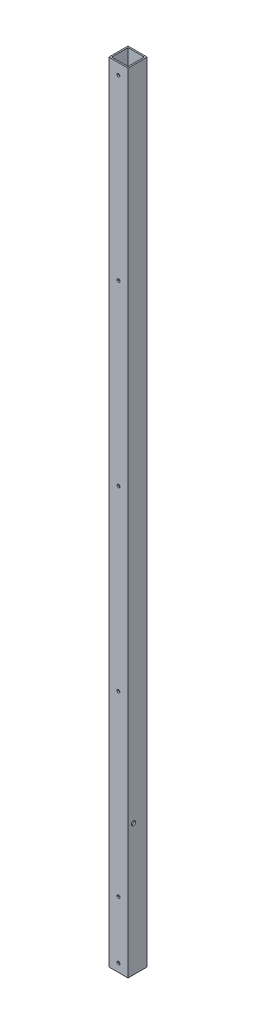
ISO-10303-21;
HEADER;
FILE_DESCRIPTION(('STEP AP214'),'2;1');
FILE_NAME('part.step','',(''),(''),'','','');
FILE_SCHEMA(('AUTOMOTIVE_DESIGN { 1 0 10303 214 1 1 1 1 }'));
ENDSEC;
DATA;
#1=APPLICATION_CONTEXT('core data for automotive mechanical design processes');
#2=APPLICATION_PROTOCOL_DEFINITION('international standard','automotive_design',2000,#1);
#3=PRODUCT_CONTEXT('',#1,'mechanical');
#4=PRODUCT('Part','Part','',(#3));
#5=PRODUCT_RELATED_PRODUCT_CATEGORY('part','',(#4));
#6=PRODUCT_DEFINITION_FORMATION('','',#4);
#7=PRODUCT_DEFINITION_CONTEXT('part definition',#1,'design');
#8=PRODUCT_DEFINITION('design','',#6,#7);
#9=PRODUCT_DEFINITION_SHAPE('','',#8);
#10=(LENGTH_UNIT() NAMED_UNIT(*) SI_UNIT(.MILLI.,.METRE.));
#11=(NAMED_UNIT(*) PLANE_ANGLE_UNIT() SI_UNIT($,.RADIAN.));
#12=(NAMED_UNIT(*) SI_UNIT($,.STERADIAN.) SOLID_ANGLE_UNIT());
#13=UNCERTAINTY_MEASURE_WITH_UNIT(LENGTH_MEASURE(1.E-05),#10,'distance_accuracy_value','');
#14=(GEOMETRIC_REPRESENTATION_CONTEXT(3) GLOBAL_UNCERTAINTY_ASSIGNED_CONTEXT((#13)) GLOBAL_UNIT_ASSIGNED_CONTEXT((#10,
#11,#12)) REPRESENTATION_CONTEXT('',''));
#15=CARTESIAN_POINT('',(0.,0.,0.));
#16=DIRECTION('',(0.,0.,1.));
#17=DIRECTION('',(1.,0.,0.));
#18=AXIS2_PLACEMENT_3D('',#15,#16,#17);
#19=CARTESIAN_POINT('',(22.225,304.8,9.525));
#20=DIRECTION('',(1.,0.,0.));
#21=DIRECTION('',(0.,0.,-1.));
#22=AXIS2_PLACEMENT_3D('',#19,#20,#21);
#23=CYLINDRICAL_SURFACE('',#22,4.7625);
#24=CARTESIAN_POINT('',(-19.05,304.8,9.525));
#25=DIRECTION('',(1.,0.,0.));
#26=DIRECTION('',(0.,0.,-1.));
#27=AXIS2_PLACEMENT_3D('',#24,#25,#26);
#28=CIRCLE('',#27,4.7625);
#29=CARTESIAN_POINT('',(-19.05,304.8,4.7625));
#30=VERTEX_POINT('',#29);
#31=EDGE_CURVE('E89',#30,#30,#28,.F.);
#32=ORIENTED_EDGE('',*,*,#31,.F.);
#33=EDGE_LOOP('',(#32));
#34=FACE_BOUND('',#33,.T.);
#35=CARTESIAN_POINT('',(-22.225,304.8,9.525));
#36=DIRECTION('',(1.,0.,0.));
#37=DIRECTION('',(0.,0.,-1.));
#38=AXIS2_PLACEMENT_3D('',#35,#36,#37);
#39=CIRCLE('',#38,4.7625);
#40=CARTESIAN_POINT('',(-22.225,304.8,4.7625));
#41=VERTEX_POINT('',#40);
#42=EDGE_CURVE('E20',#41,#41,#39,.T.);
#43=ORIENTED_EDGE('',*,*,#42,.F.);
#44=EDGE_LOOP('',(#43));
#45=FACE_BOUND('',#44,.T.);
#46=ADVANCED_FACE('F17',(#34,#45),#23,.F.);
#47=CARTESIAN_POINT('',(0.,19.05,22.225));
#48=DIRECTION('',(0.,0.,1.));
#49=DIRECTION('',(1.,0.,0.));
#50=AXIS2_PLACEMENT_3D('',#47,#48,#49);
#51=CYLINDRICAL_SURFACE('',#50,3.3655);
#52=CARTESIAN_POINT('',(0.,19.05,-19.05));
#53=DIRECTION('',(0.,0.,1.));
#54=DIRECTION('',(1.,0.,0.));
#55=AXIS2_PLACEMENT_3D('',#52,#53,#54);
#56=CIRCLE('',#55,3.3655);
#57=CARTESIAN_POINT('',(3.3655,19.05,-19.05));
#58=VERTEX_POINT('',#57);
#59=EDGE_CURVE('E125',#58,#58,#56,.F.);
#60=ORIENTED_EDGE('',*,*,#59,.F.);
#61=EDGE_LOOP('',(#60));
#62=FACE_BOUND('',#61,.T.);
#63=CARTESIAN_POINT('',(0.,19.05,-22.225));
#64=DIRECTION('',(0.,0.,1.));
#65=DIRECTION('',(1.,0.,0.));
#66=AXIS2_PLACEMENT_3D('',#63,#64,#65);
#67=CIRCLE('',#66,3.3655);
#68=CARTESIAN_POINT('',(3.3655,19.05,-22.225));
#69=VERTEX_POINT('',#68);
#70=EDGE_CURVE('E119',#69,#69,#67,.T.);
#71=ORIENTED_EDGE('',*,*,#70,.F.);
#72=EDGE_LOOP('',(#71));
#73=FACE_BOUND('',#72,.T.);
#74=ADVANCED_FACE('F210',(#62,#73),#51,.F.);
#75=CARTESIAN_POINT('',(0.,1803.4,22.225));
#76=DIRECTION('',(0.,0.,1.));
#77=DIRECTION('',(1.,0.,0.));
#78=AXIS2_PLACEMENT_3D('',#75,#76,#77);
#79=CYLINDRICAL_SURFACE('',#78,3.3655);
#80=CARTESIAN_POINT('',(0.,1803.4,-19.05));
#81=DIRECTION('',(0.,0.,1.));
#82=DIRECTION('',(1.,0.,0.));
#83=AXIS2_PLACEMENT_3D('',#80,#81,#82);
#84=CIRCLE('',#83,3.3655);
#85=CARTESIAN_POINT('',(3.3655,1803.4,-19.05));
#86=VERTEX_POINT('',#85);
#87=EDGE_CURVE('E179',#86,#86,#84,.F.);
#88=ORIENTED_EDGE('',*,*,#87,.F.);
#89=EDGE_LOOP('',(#88));
#90=FACE_BOUND('',#89,.T.);
#91=CARTESIAN_POINT('',(0.,1803.4,-22.225));
#92=DIRECTION('',(0.,0.,1.));
#93=DIRECTION('',(1.,0.,0.));
#94=AXIS2_PLACEMENT_3D('',#91,#92,#93);
#95=CIRCLE('',#94,3.3655);
#96=CARTESIAN_POINT('',(3.3655,1803.4,-22.225));
#97=VERTEX_POINT('',#96);
#98=EDGE_CURVE('E163',#97,#97,#95,.T.);
#99=ORIENTED_EDGE('',*,*,#98,.F.);
#100=EDGE_LOOP('',(#99));
#101=FACE_BOUND('',#100,.T.);
#102=ADVANCED_FACE('F216',(#90,#101),#79,.F.);
#103=CARTESIAN_POINT('',(0.,1390.65,22.225));
#104=DIRECTION('',(0.,0.,1.));
#105=DIRECTION('',(1.,0.,0.));
#106=AXIS2_PLACEMENT_3D('',#103,#104,#105);
#107=CYLINDRICAL_SURFACE('',#106,3.3655);
#108=CARTESIAN_POINT('',(0.,1390.65,-19.05));
#109=DIRECTION('',(0.,0.,1.));
#110=DIRECTION('',(1.,0.,0.));
#111=AXIS2_PLACEMENT_3D('',#108,#109,#110);
#112=CIRCLE('',#111,3.3655);
#113=CARTESIAN_POINT('',(3.3655,1390.65,-19.05));
#114=VERTEX_POINT('',#113);
#115=EDGE_CURVE('E176',#114,#114,#112,.F.);
#116=ORIENTED_EDGE('',*,*,#115,.F.);
#117=EDGE_LOOP('',(#116));
#118=FACE_BOUND('',#117,.T.);
#119=CARTESIAN_POINT('',(0.,1390.65,-22.225));
#120=DIRECTION('',(0.,0.,1.));
#121=DIRECTION('',(1.,0.,0.));
#122=AXIS2_PLACEMENT_3D('',#119,#120,#121);
#123=CIRCLE('',#122,3.3655);
#124=CARTESIAN_POINT('',(3.3655,1390.65,-22.225));
#125=VERTEX_POINT('',#124);
#126=EDGE_CURVE('E160',#125,#125,#123,.T.);
#127=ORIENTED_EDGE('',*,*,#126,.F.);
#128=EDGE_LOOP('',(#127));
#129=FACE_BOUND('',#128,.T.);
#130=ADVANCED_FACE('F296',(#118,#129),#107,.F.);
#131=CARTESIAN_POINT('',(0.,977.9,22.225));
#132=DIRECTION('',(0.,0.,1.));
#133=DIRECTION('',(1.,0.,0.));
#134=AXIS2_PLACEMENT_3D('',#131,#132,#133);
#135=CYLINDRICAL_SURFACE('',#134,3.3655);
#136=CARTESIAN_POINT('',(0.,977.9,-19.05));
#137=DIRECTION('',(0.,0.,1.));
#138=DIRECTION('',(1.,0.,0.));
#139=AXIS2_PLACEMENT_3D('',#136,#137,#138);
#140=CIRCLE('',#139,3.3655);
#141=CARTESIAN_POINT('',(3.3655,977.9,-19.05));
#142=VERTEX_POINT('',#141);
#143=EDGE_CURVE('E173',#142,#142,#140,.F.);
#144=ORIENTED_EDGE('',*,*,#143,.F.);
#145=EDGE_LOOP('',(#144));
#146=FACE_BOUND('',#145,.T.);
#147=CARTESIAN_POINT('',(0.,977.9,-22.225));
#148=DIRECTION('',(0.,0.,1.));
#149=DIRECTION('',(1.,0.,0.));
#150=AXIS2_PLACEMENT_3D('',#147,#148,#149);
#151=CIRCLE('',#150,3.3655);
#152=CARTESIAN_POINT('',(3.3655,977.9,-22.225));
#153=VERTEX_POINT('',#152);
#154=EDGE_CURVE('E157',#153,#153,#151,.T.);
#155=ORIENTED_EDGE('',*,*,#154,.F.);
#156=EDGE_LOOP('',(#155));
#157=FACE_BOUND('',#156,.T.);
#158=ADVANCED_FACE('F292',(#146,#157),#135,.F.);
#159=CARTESIAN_POINT('',(0.,565.15,22.225));
#160=DIRECTION('',(0.,0.,1.));
#161=DIRECTION('',(1.,0.,0.));
#162=AXIS2_PLACEMENT_3D('',#159,#160,#161);
#163=CYLINDRICAL_SURFACE('',#162,3.3655);
#164=CARTESIAN_POINT('',(0.,565.15,-19.05));
#165=DIRECTION('',(0.,0.,1.));
#166=DIRECTION('',(1.,0.,0.));
#167=AXIS2_PLACEMENT_3D('',#164,#165,#166);
#168=CIRCLE('',#167,3.3655);
#169=CARTESIAN_POINT('',(3.3655,565.15,-19.05));
#170=VERTEX_POINT('',#169);
#171=EDGE_CURVE('E170',#170,#170,#168,.F.);
#172=ORIENTED_EDGE('',*,*,#171,.F.);
#173=EDGE_LOOP('',(#172));
#174=FACE_BOUND('',#173,.T.);
#175=CARTESIAN_POINT('',(0.,565.15,-22.225));
#176=DIRECTION('',(0.,0.,1.));
#177=DIRECTION('',(1.,0.,0.));
#178=AXIS2_PLACEMENT_3D('',#175,#176,#177);
#179=CIRCLE('',#178,3.3655);
#180=CARTESIAN_POINT('',(3.3655,565.15,-22.225));
#181=VERTEX_POINT('',#180);
#182=EDGE_CURVE('E154',#181,#181,#179,.T.);
#183=ORIENTED_EDGE('',*,*,#182,.F.);
#184=EDGE_LOOP('',(#183));
#185=FACE_BOUND('',#184,.T.);
#186=ADVANCED_FACE('F288',(#174,#185),#163,.F.);
#187=CARTESIAN_POINT('',(0.,152.4,22.225));
#188=DIRECTION('',(0.,0.,1.));
#189=DIRECTION('',(1.,0.,0.));
#190=AXIS2_PLACEMENT_3D('',#187,#188,#189);
#191=CYLINDRICAL_SURFACE('',#190,3.3655);
#192=CARTESIAN_POINT('',(0.,152.4,-19.05));
#193=DIRECTION('',(0.,0.,1.));
#194=DIRECTION('',(1.,0.,0.));
#195=AXIS2_PLACEMENT_3D('',#192,#193,#194);
#196=CIRCLE('',#195,3.3655);
#197=CARTESIAN_POINT('',(3.3655,152.4,-19.05));
#198=VERTEX_POINT('',#197);
#199=EDGE_CURVE('E124',#198,#198,#196,.F.);
#200=ORIENTED_EDGE('',*,*,#199,.F.);
#201=EDGE_LOOP('',(#200));
#202=FACE_BOUND('',#201,.T.);
#203=CARTESIAN_POINT('',(0.,152.4,-22.225));
#204=DIRECTION('',(0.,0.,1.));
#205=DIRECTION('',(1.,0.,0.));
#206=AXIS2_PLACEMENT_3D('',#203,#204,#205);
#207=CIRCLE('',#206,3.3655);
#208=CARTESIAN_POINT('',(3.3655,152.4,-22.225));
#209=VERTEX_POINT('',#208);
#210=EDGE_CURVE('E115',#209,#209,#207,.T.);
#211=ORIENTED_EDGE('',*,*,#210,.F.);
#212=EDGE_LOOP('',(#211));
#213=FACE_BOUND('',#212,.T.);
#214=ADVANCED_FACE('F284',(#202,#213),#191,.F.);
#215=CARTESIAN_POINT('',(0.,19.05,22.225));
#216=DIRECTION('',(0.,0.,1.));
#217=DIRECTION('',(1.,0.,0.));
#218=AXIS2_PLACEMENT_3D('',#215,#216,#217);
#219=CYLINDRICAL_SURFACE('',#218,3.3655);
#220=CARTESIAN_POINT('',(0.,19.05,19.05));
#221=DIRECTION('',(0.,0.,1.));
#222=DIRECTION('',(1.,0.,0.));
#223=AXIS2_PLACEMENT_3D('',#220,#221,#222);
#224=CIRCLE('',#223,3.3655);
#225=CARTESIAN_POINT('',(3.3655,19.05,19.05));
#226=VERTEX_POINT('',#225);
#227=EDGE_CURVE('E199',#226,#226,#224,.T.);
#228=ORIENTED_EDGE('',*,*,#227,.F.);
#229=EDGE_LOOP('',(#228));
#230=FACE_BOUND('',#229,.T.);
#231=CARTESIAN_POINT('',(0.,19.05,22.225));
#232=DIRECTION('',(0.,0.,1.));
#233=DIRECTION('',(1.,0.,0.));
#234=AXIS2_PLACEMENT_3D('',#231,#232,#233);
#235=CIRCLE('',#234,3.3655);
#236=CARTESIAN_POINT('',(3.3655,19.05,22.225));
#237=VERTEX_POINT('',#236);
#238=EDGE_CURVE('E148',#237,#237,#235,.F.);
#239=ORIENTED_EDGE('',*,*,#238,.F.);
#240=EDGE_LOOP('',(#239));
#241=FACE_BOUND('',#240,.T.);
#242=ADVANCED_FACE('F280',(#230,#241),#219,.F.);
#243=CARTESIAN_POINT('',(0.,1803.4,22.225));
#244=DIRECTION('',(0.,0.,1.));
#245=DIRECTION('',(1.,0.,0.));
#246=AXIS2_PLACEMENT_3D('',#243,#244,#245);
#247=CYLINDRICAL_SURFACE('',#246,3.3655);
#248=CARTESIAN_POINT('',(0.,1803.4,19.05));
#249=DIRECTION('',(0.,0.,1.));
#250=DIRECTION('',(1.,0.,0.));
#251=AXIS2_PLACEMENT_3D('',#248,#249,#250);
#252=CIRCLE('',#251,3.3655);
#253=CARTESIAN_POINT('',(3.3655,1803.4,19.05));
#254=VERTEX_POINT('',#253);
#255=EDGE_CURVE('E197',#254,#254,#252,.T.);
#256=ORIENTED_EDGE('',*,*,#255,.F.);
#257=EDGE_LOOP('',(#256));
#258=FACE_BOUND('',#257,.T.);
#259=CARTESIAN_POINT('',(0.,1803.4,22.225));
#260=DIRECTION('',(0.,0.,1.));
#261=DIRECTION('',(1.,0.,0.));
#262=AXIS2_PLACEMENT_3D('',#259,#260,#261);
#263=CIRCLE('',#262,3.3655);
#264=CARTESIAN_POINT('',(3.3655,1803.4,22.225));
#265=VERTEX_POINT('',#264);
#266=EDGE_CURVE('E145',#265,#265,#263,.F.);
#267=ORIENTED_EDGE('',*,*,#266,.F.);
#268=EDGE_LOOP('',(#267));
#269=FACE_BOUND('',#268,.T.);
#270=ADVANCED_FACE('F276',(#258,#269),#247,.F.);
#271=CARTESIAN_POINT('',(0.,1390.65,22.225));
#272=DIRECTION('',(0.,0.,1.));
#273=DIRECTION('',(1.,0.,0.));
#274=AXIS2_PLACEMENT_3D('',#271,#272,#273);
#275=CYLINDRICAL_SURFACE('',#274,3.3655);
#276=CARTESIAN_POINT('',(0.,1390.65,19.05));
#277=DIRECTION('',(0.,0.,1.));
#278=DIRECTION('',(1.,0.,0.));
#279=AXIS2_PLACEMENT_3D('',#276,#277,#278);
#280=CIRCLE('',#279,3.3655);
#281=CARTESIAN_POINT('',(3.3655,1390.65,19.05));
#282=VERTEX_POINT('',#281);
#283=EDGE_CURVE('E194',#282,#282,#280,.T.);
#284=ORIENTED_EDGE('',*,*,#283,.F.);
#285=EDGE_LOOP('',(#284));
#286=FACE_BOUND('',#285,.T.);
#287=CARTESIAN_POINT('',(0.,1390.65,22.225));
#288=DIRECTION('',(0.,0.,1.));
#289=DIRECTION('',(1.,0.,0.));
#290=AXIS2_PLACEMENT_3D('',#287,#288,#289);
#291=CIRCLE('',#290,3.3655);
#292=CARTESIAN_POINT('',(3.3655,1390.65,22.225));
#293=VERTEX_POINT('',#292);
#294=EDGE_CURVE('E142',#293,#293,#291,.F.);
#295=ORIENTED_EDGE('',*,*,#294,.F.);
#296=EDGE_LOOP('',(#295));
#297=FACE_BOUND('',#296,.T.);
#298=ADVANCED_FACE('F272',(#286,#297),#275,.F.);
#299=CARTESIAN_POINT('',(0.,977.9,22.225));
#300=DIRECTION('',(0.,0.,1.));
#301=DIRECTION('',(1.,0.,0.));
#302=AXIS2_PLACEMENT_3D('',#299,#300,#301);
#303=CYLINDRICAL_SURFACE('',#302,3.3655);
#304=CARTESIAN_POINT('',(0.,977.9,19.05));
#305=DIRECTION('',(0.,0.,1.));
#306=DIRECTION('',(1.,0.,0.));
#307=AXIS2_PLACEMENT_3D('',#304,#305,#306);
#308=CIRCLE('',#307,3.3655);
#309=CARTESIAN_POINT('',(3.3655,977.9,19.05));
#310=VERTEX_POINT('',#309);
#311=EDGE_CURVE('E191',#310,#310,#308,.T.);
#312=ORIENTED_EDGE('',*,*,#311,.F.);
#313=EDGE_LOOP('',(#312));
#314=FACE_BOUND('',#313,.T.);
#315=CARTESIAN_POINT('',(0.,977.9,22.225));
#316=DIRECTION('',(0.,0.,1.));
#317=DIRECTION('',(1.,0.,0.));
#318=AXIS2_PLACEMENT_3D('',#315,#316,#317);
#319=CIRCLE('',#318,3.3655);
#320=CARTESIAN_POINT('',(3.3655,977.9,22.225));
#321=VERTEX_POINT('',#320);
#322=EDGE_CURVE('E139',#321,#321,#319,.F.);
#323=ORIENTED_EDGE('',*,*,#322,.F.);
#324=EDGE_LOOP('',(#323));
#325=FACE_BOUND('',#324,.T.);
#326=ADVANCED_FACE('F268',(#314,#325),#303,.F.);
#327=CARTESIAN_POINT('',(0.,565.15,22.225));
#328=DIRECTION('',(0.,0.,1.));
#329=DIRECTION('',(1.,0.,0.));
#330=AXIS2_PLACEMENT_3D('',#327,#328,#329);
#331=CYLINDRICAL_SURFACE('',#330,3.3655);
#332=CARTESIAN_POINT('',(0.,565.15,19.05));
#333=DIRECTION('',(0.,0.,1.));
#334=DIRECTION('',(1.,0.,0.));
#335=AXIS2_PLACEMENT_3D('',#332,#333,#334);
#336=CIRCLE('',#335,3.3655);
#337=CARTESIAN_POINT('',(3.3655,565.15,19.05));
#338=VERTEX_POINT('',#337);
#339=EDGE_CURVE('E188',#338,#338,#336,.T.);
#340=ORIENTED_EDGE('',*,*,#339,.F.);
#341=EDGE_LOOP('',(#340));
#342=FACE_BOUND('',#341,.T.);
#343=CARTESIAN_POINT('',(0.,565.15,22.225));
#344=DIRECTION('',(0.,0.,1.));
#345=DIRECTION('',(1.,0.,0.));
#346=AXIS2_PLACEMENT_3D('',#343,#344,#345);
#347=CIRCLE('',#346,3.3655);
#348=CARTESIAN_POINT('',(3.3655,565.15,22.225));
#349=VERTEX_POINT('',#348);
#350=EDGE_CURVE('E136',#349,#349,#347,.F.);
#351=ORIENTED_EDGE('',*,*,#350,.F.);
#352=EDGE_LOOP('',(#351));
#353=FACE_BOUND('',#352,.T.);
#354=ADVANCED_FACE('F264',(#342,#353),#331,.F.);
#355=CARTESIAN_POINT('',(0.,152.4,22.225));
#356=DIRECTION('',(0.,0.,1.));
#357=DIRECTION('',(1.,0.,0.));
#358=AXIS2_PLACEMENT_3D('',#355,#356,#357);
#359=CYLINDRICAL_SURFACE('',#358,3.3655);
#360=CARTESIAN_POINT('',(0.,152.4,19.05));
#361=DIRECTION('',(0.,0.,1.));
#362=DIRECTION('',(1.,0.,0.));
#363=AXIS2_PLACEMENT_3D('',#360,#361,#362);
#364=CIRCLE('',#363,3.3655);
#365=CARTESIAN_POINT('',(3.3655,152.4,19.05));
#366=VERTEX_POINT('',#365);
#367=EDGE_CURVE('E90',#366,#366,#364,.T.);
#368=ORIENTED_EDGE('',*,*,#367,.F.);
#369=EDGE_LOOP('',(#368));
#370=FACE_BOUND('',#369,.T.);
#371=CARTESIAN_POINT('',(0.,152.4,22.225));
#372=DIRECTION('',(0.,0.,1.));
#373=DIRECTION('',(1.,0.,0.));
#374=AXIS2_PLACEMENT_3D('',#371,#372,#373);
#375=CIRCLE('',#374,3.3655);
#376=CARTESIAN_POINT('',(3.3655,152.4,22.225));
#377=VERTEX_POINT('',#376);
#378=EDGE_CURVE('E132',#377,#377,#375,.F.);
#379=ORIENTED_EDGE('',*,*,#378,.F.);
#380=EDGE_LOOP('',(#379));
#381=FACE_BOUND('',#380,.T.);
#382=ADVANCED_FACE('F261',(#370,#381),#359,.F.);
#383=CARTESIAN_POINT('',(-22.225,0.,-22.225));
#384=DIRECTION('',(-1.,0.,0.));
#385=DIRECTION('',(0.,0.,1.));
#386=AXIS2_PLACEMENT_3D('',#383,#384,#385);
#387=PLANE('',#386);
#388=ORIENTED_EDGE('',*,*,#42,.T.);
#389=EDGE_LOOP('',(#388));
#390=FACE_BOUND('',#389,.T.);
#391=DIRECTION('',(0.,1.,0.));
#392=VECTOR('',#391,1.);
#393=CARTESIAN_POINT('',(-22.225,0.,-22.225));
#394=LINE('',#393,#392);
#395=CARTESIAN_POINT('',(-22.225,0.,-22.225));
#396=VERTEX_POINT('',#395);
#397=CARTESIAN_POINT('',(-22.225,1828.8,-22.225));
#398=VERTEX_POINT('',#397);
#399=EDGE_CURVE('E116',#396,#398,#394,.T.);
#400=ORIENTED_EDGE('',*,*,#399,.F.);
#401=DIRECTION('',(0.,0.,1.));
#402=VECTOR('',#401,1.);
#403=CARTESIAN_POINT('',(-22.225,0.,0.));
#404=LINE('',#403,#402);
#405=CARTESIAN_POINT('',(-22.225,0.,22.225));
#406=VERTEX_POINT('',#405);
#407=EDGE_CURVE('E323',#396,#406,#404,.T.);
#408=ORIENTED_EDGE('',*,*,#407,.T.);
#409=DIRECTION('',(0.,1.,0.));
#410=VECTOR('',#409,1.);
#411=CARTESIAN_POINT('',(-22.225,0.,22.225));
#412=LINE('',#411,#410);
#413=CARTESIAN_POINT('',(-22.225,1828.8,22.225));
#414=VERTEX_POINT('',#413);
#415=EDGE_CURVE('E151',#414,#406,#412,.F.);
#416=ORIENTED_EDGE('',*,*,#415,.F.);
#417=DIRECTION('',(0.,0.,1.));
#418=VECTOR('',#417,1.);
#419=CARTESIAN_POINT('',(-22.225,1828.8,0.));
#420=LINE('',#419,#418);
#421=EDGE_CURVE('E110',#398,#414,#420,.T.);
#422=ORIENTED_EDGE('',*,*,#421,.F.);
#423=EDGE_LOOP('',(#400,#408,#416,#422));
#424=FACE_BOUND('',#423,.T.);
#425=ADVANCED_FACE('F206',(#390,#424),#387,.T.);
#426=CARTESIAN_POINT('',(19.05,0.,19.05));
#427=DIRECTION('',(0.,0.,-1.));
#428=DIRECTION('',(-1.,0.,0.));
#429=AXIS2_PLACEMENT_3D('',#426,#427,#428);
#430=PLANE('',#429);
#431=ORIENTED_EDGE('',*,*,#367,.T.);
#432=EDGE_LOOP('',(#431));
#433=FACE_BOUND('',#432,.T.);
#434=ORIENTED_EDGE('',*,*,#339,.T.);
#435=EDGE_LOOP('',(#434));
#436=FACE_BOUND('',#435,.T.);
#437=ORIENTED_EDGE('',*,*,#311,.T.);
#438=EDGE_LOOP('',(#437));
#439=FACE_BOUND('',#438,.T.);
#440=ORIENTED_EDGE('',*,*,#283,.T.);
#441=EDGE_LOOP('',(#440));
#442=FACE_BOUND('',#441,.T.);
#443=ORIENTED_EDGE('',*,*,#255,.T.);
#444=EDGE_LOOP('',(#443));
#445=FACE_BOUND('',#444,.T.);
#446=ORIENTED_EDGE('',*,*,#227,.T.);
#447=EDGE_LOOP('',(#446));
#448=FACE_BOUND('',#447,.T.);
#449=DIRECTION('',(0.,1.,0.));
#450=VECTOR('',#449,1.);
#451=CARTESIAN_POINT('',(19.05,0.,19.05));
#452=LINE('',#451,#450);
#453=CARTESIAN_POINT('',(19.05,0.,19.05));
#454=VERTEX_POINT('',#453);
#455=CARTESIAN_POINT('',(19.05,1828.8,19.05));
#456=VERTEX_POINT('',#455);
#457=EDGE_CURVE('E122',#454,#456,#452,.T.);
#458=ORIENTED_EDGE('',*,*,#457,.F.);
#459=DIRECTION('',(1.,0.,0.));
#460=VECTOR('',#459,1.);
#461=CARTESIAN_POINT('',(0.,0.,19.05));
#462=LINE('',#461,#460);
#463=CARTESIAN_POINT('',(-19.05,0.,19.05));
#464=VERTEX_POINT('',#463);
#465=EDGE_CURVE('E86',#454,#464,#462,.F.);
#466=ORIENTED_EDGE('',*,*,#465,.T.);
#467=DIRECTION('',(0.,1.,0.));
#468=VECTOR('',#467,1.);
#469=CARTESIAN_POINT('',(-19.05,0.,19.05));
#470=LINE('',#469,#468);
#471=CARTESIAN_POINT('',(-19.05,1828.8,19.05));
#472=VERTEX_POINT('',#471);
#473=EDGE_CURVE('E79',#472,#464,#470,.F.);
#474=ORIENTED_EDGE('',*,*,#473,.F.);
#475=DIRECTION('',(1.,0.,0.));
#476=VECTOR('',#475,1.);
#477=CARTESIAN_POINT('',(0.,1828.8,19.05));
#478=LINE('',#477,#476);
#479=EDGE_CURVE('E83',#456,#472,#478,.F.);
#480=ORIENTED_EDGE('',*,*,#479,.F.);
#481=EDGE_LOOP('',(#458,#466,#474,#480));
#482=FACE_BOUND('',#481,.T.);
#483=ADVANCED_FACE('F81',(#433,#436,#439,#442,#445,#448,#482),#430,.T.);
#484=CARTESIAN_POINT('',(-19.05,0.,19.05));
#485=DIRECTION('',(1.,0.,0.));
#486=DIRECTION('',(0.,0.,-1.));
#487=AXIS2_PLACEMENT_3D('',#484,#485,#486);
#488=PLANE('',#487);
#489=ORIENTED_EDGE('',*,*,#31,.T.);
#490=EDGE_LOOP('',(#489));
#491=FACE_BOUND('',#490,.T.);
#492=ORIENTED_EDGE('',*,*,#473,.T.);
#493=DIRECTION('',(0.,0.,1.));
#494=VECTOR('',#493,1.);
#495=CARTESIAN_POINT('',(-19.05,0.,0.));
#496=LINE('',#495,#494);
#497=CARTESIAN_POINT('',(-19.05,0.,-19.05));
#498=VERTEX_POINT('',#497);
#499=EDGE_CURVE('E332',#464,#498,#496,.F.);
#500=ORIENTED_EDGE('',*,*,#499,.T.);
#501=DIRECTION('',(0.,1.,0.));
#502=VECTOR('',#501,1.);
#503=CARTESIAN_POINT('',(-19.05,0.,-19.05));
#504=LINE('',#503,#502);
#505=CARTESIAN_POINT('',(-19.05,1828.8,-19.05));
#506=VERTEX_POINT('',#505);
#507=EDGE_CURVE('E96',#506,#498,#504,.F.);
#508=ORIENTED_EDGE('',*,*,#507,.F.);
#509=DIRECTION('',(0.,0.,1.));
#510=VECTOR('',#509,1.);
#511=CARTESIAN_POINT('',(-19.05,1828.8,0.));
#512=LINE('',#511,#510);
#513=EDGE_CURVE('E93',#472,#506,#512,.F.);
#514=ORIENTED_EDGE('',*,*,#513,.F.);
#515=EDGE_LOOP('',(#492,#500,#508,#514));
#516=FACE_BOUND('',#515,.T.);
#517=ADVANCED_FACE('F94',(#491,#516),#488,.T.);
#518=CARTESIAN_POINT('',(-19.05,0.,-19.05));
#519=DIRECTION('',(0.,0.,1.));
#520=DIRECTION('',(1.,0.,0.));
#521=AXIS2_PLACEMENT_3D('',#518,#519,#520);
#522=PLANE('',#521);
#523=ORIENTED_EDGE('',*,*,#199,.T.);
#524=EDGE_LOOP('',(#523));
#525=FACE_BOUND('',#524,.T.);
#526=ORIENTED_EDGE('',*,*,#171,.T.);
#527=EDGE_LOOP('',(#526));
#528=FACE_BOUND('',#527,.T.);
#529=ORIENTED_EDGE('',*,*,#143,.T.);
#530=EDGE_LOOP('',(#529));
#531=FACE_BOUND('',#530,.T.);
#532=ORIENTED_EDGE('',*,*,#115,.T.);
#533=EDGE_LOOP('',(#532));
#534=FACE_BOUND('',#533,.T.);
#535=ORIENTED_EDGE('',*,*,#87,.T.);
#536=EDGE_LOOP('',(#535));
#537=FACE_BOUND('',#536,.T.);
#538=ORIENTED_EDGE('',*,*,#59,.T.);
#539=EDGE_LOOP('',(#538));
#540=FACE_BOUND('',#539,.T.);
#541=ORIENTED_EDGE('',*,*,#507,.T.);
#542=DIRECTION('',(1.,0.,0.));
#543=VECTOR('',#542,1.);
#544=CARTESIAN_POINT('',(0.,0.,-19.05));
#545=LINE('',#544,#543);
#546=CARTESIAN_POINT('',(19.05,0.,-19.05));
#547=VERTEX_POINT('',#546);
#548=EDGE_CURVE('E131',#498,#547,#545,.T.);
#549=ORIENTED_EDGE('',*,*,#548,.T.);
#550=DIRECTION('',(0.,1.,0.));
#551=VECTOR('',#550,1.);
#552=CARTESIAN_POINT('',(19.05,0.,-19.05));
#553=LINE('',#552,#551);
#554=CARTESIAN_POINT('',(19.05,1828.8,-19.05));
#555=VERTEX_POINT('',#554);
#556=EDGE_CURVE('E120',#555,#547,#553,.F.);
#557=ORIENTED_EDGE('',*,*,#556,.F.);
#558=DIRECTION('',(1.,0.,0.));
#559=VECTOR('',#558,1.);
#560=CARTESIAN_POINT('',(0.,1828.8,-19.05));
#561=LINE('',#560,#559);
#562=EDGE_CURVE('E100',#506,#555,#561,.T.);
#563=ORIENTED_EDGE('',*,*,#562,.F.);
#564=EDGE_LOOP('',(#541,#549,#557,#563));
#565=FACE_BOUND('',#564,.T.);
#566=ADVANCED_FACE('F248',(#525,#528,#531,#534,#537,#540,#565),#522,.T.);
#567=CARTESIAN_POINT('',(19.05,0.,-19.05));
#568=DIRECTION('',(-1.,0.,0.));
#569=DIRECTION('',(0.,0.,1.));
#570=AXIS2_PLACEMENT_3D('',#567,#568,#569);
#571=PLANE('',#570);
#572=CARTESIAN_POINT('',(19.05,304.8,9.525));
#573=DIRECTION('',(1.,0.,0.));
#574=DIRECTION('',(0.,0.,-1.));
#575=AXIS2_PLACEMENT_3D('',#572,#573,#574);
#576=CIRCLE('',#575,4.7625);
#577=CARTESIAN_POINT('',(19.05,304.8,4.7625));
#578=VERTEX_POINT('',#577);
#579=EDGE_CURVE('E127',#578,#578,#576,.T.);
#580=ORIENTED_EDGE('',*,*,#579,.T.);
#581=EDGE_LOOP('',(#580));
#582=FACE_BOUND('',#581,.T.);
#583=ORIENTED_EDGE('',*,*,#556,.T.);
#584=DIRECTION('',(0.,0.,1.));
#585=VECTOR('',#584,1.);
#586=CARTESIAN_POINT('',(19.05,0.,0.));
#587=LINE('',#586,#585);
#588=EDGE_CURVE('E335',#547,#454,#587,.T.);
#589=ORIENTED_EDGE('',*,*,#588,.T.);
#590=ORIENTED_EDGE('',*,*,#457,.T.);
#591=DIRECTION('',(0.,0.,1.));
#592=VECTOR('',#591,1.);
#593=CARTESIAN_POINT('',(19.05,1828.8,0.));
#594=LINE('',#593,#592);
#595=EDGE_CURVE('E106',#555,#456,#594,.T.);
#596=ORIENTED_EDGE('',*,*,#595,.F.);
#597=EDGE_LOOP('',(#583,#589,#590,#596));
#598=FACE_BOUND('',#597,.T.);
#599=ADVANCED_FACE('F244',(#582,#598),#571,.T.);
#600=CARTESIAN_POINT('',(22.225,0.,-22.225));
#601=DIRECTION('',(0.,0.,-1.));
#602=DIRECTION('',(-1.,0.,0.));
#603=AXIS2_PLACEMENT_3D('',#600,#601,#602);
#604=PLANE('',#603);
#605=ORIENTED_EDGE('',*,*,#210,.T.);
#606=EDGE_LOOP('',(#605));
#607=FACE_BOUND('',#606,.T.);
#608=ORIENTED_EDGE('',*,*,#182,.T.);
#609=EDGE_LOOP('',(#608));
#610=FACE_BOUND('',#609,.T.);
#611=ORIENTED_EDGE('',*,*,#154,.T.);
#612=EDGE_LOOP('',(#611));
#613=FACE_BOUND('',#612,.T.);
#614=ORIENTED_EDGE('',*,*,#126,.T.);
#615=EDGE_LOOP('',(#614));
#616=FACE_BOUND('',#615,.T.);
#617=ORIENTED_EDGE('',*,*,#98,.T.);
#618=EDGE_LOOP('',(#617));
#619=FACE_BOUND('',#618,.T.);
#620=ORIENTED_EDGE('',*,*,#70,.T.);
#621=EDGE_LOOP('',(#620));
#622=FACE_BOUND('',#621,.T.);
#623=DIRECTION('',(0.,1.,0.));
#624=VECTOR('',#623,1.);
#625=CARTESIAN_POINT('',(22.225,0.,-22.225));
#626=LINE('',#625,#624);
#627=CARTESIAN_POINT('',(22.225,0.,-22.225));
#628=VERTEX_POINT('',#627);
#629=CARTESIAN_POINT('',(22.225,1828.8,-22.225));
#630=VERTEX_POINT('',#629);
#631=EDGE_CURVE('E130',#628,#630,#626,.T.);
#632=ORIENTED_EDGE('',*,*,#631,.F.);
#633=DIRECTION('',(1.,0.,0.));
#634=VECTOR('',#633,1.);
#635=CARTESIAN_POINT('',(0.,0.,-22.225));
#636=LINE('',#635,#634);
#637=EDGE_CURVE('E135',#628,#396,#636,.F.);
#638=ORIENTED_EDGE('',*,*,#637,.T.);
#639=ORIENTED_EDGE('',*,*,#399,.T.);
#640=DIRECTION('',(1.,0.,0.));
#641=VECTOR('',#640,1.);
#642=CARTESIAN_POINT('',(0.,1828.8,-22.225));
#643=LINE('',#642,#641);
#644=EDGE_CURVE('E107',#630,#398,#643,.F.);
#645=ORIENTED_EDGE('',*,*,#644,.F.);
#646=EDGE_LOOP('',(#632,#638,#639,#645));
#647=FACE_BOUND('',#646,.T.);
#648=ADVANCED_FACE('F241',(#607,#610,#613,#616,#619,#622,#647),#604,.T.);
#649=CARTESIAN_POINT('',(0.,1828.8,0.));
#650=DIRECTION('',(0.,1.,0.));
#651=DIRECTION('',(0.,0.,1.));
#652=AXIS2_PLACEMENT_3D('',#649,#650,#651);
#653=PLANE('',#652);
#654=ORIENTED_EDGE('',*,*,#562,.T.);
#655=ORIENTED_EDGE('',*,*,#595,.T.);
#656=ORIENTED_EDGE('',*,*,#479,.T.);
#657=ORIENTED_EDGE('',*,*,#513,.T.);
#658=EDGE_LOOP('',(#654,#655,#656,#657));
#659=FACE_BOUND('',#658,.T.);
#660=DIRECTION('',(0.,0.,-1.));
#661=VECTOR('',#660,1.);
#662=CARTESIAN_POINT('',(22.225,1828.8,22.225));
#663=LINE('',#662,#661);
#664=CARTESIAN_POINT('',(22.225,1828.8,22.225));
#665=VERTEX_POINT('',#664);
#666=EDGE_CURVE('E319',#630,#665,#663,.F.);
#667=ORIENTED_EDGE('',*,*,#666,.F.);
#668=ORIENTED_EDGE('',*,*,#644,.T.);
#669=ORIENTED_EDGE('',*,*,#421,.T.);
#670=DIRECTION('',(1.,0.,0.));
#671=VECTOR('',#670,1.);
#672=CARTESIAN_POINT('',(-22.225,1828.8,22.225));
#673=LINE('',#672,#671);
#674=EDGE_CURVE('E341',#665,#414,#673,.F.);
#675=ORIENTED_EDGE('',*,*,#674,.F.);
#676=EDGE_LOOP('',(#667,#668,#669,#675));
#677=FACE_BOUND('',#676,.T.);
#678=ADVANCED_FACE('F103',(#659,#677),#653,.T.);
#679=CARTESIAN_POINT('',(-22.225,0.,22.225));
#680=DIRECTION('',(0.,0.,1.));
#681=DIRECTION('',(1.,0.,0.));
#682=AXIS2_PLACEMENT_3D('',#679,#680,#681);
#683=PLANE('',#682);
#684=ORIENTED_EDGE('',*,*,#378,.T.);
#685=EDGE_LOOP('',(#684));
#686=FACE_BOUND('',#685,.T.);
#687=ORIENTED_EDGE('',*,*,#350,.T.);
#688=EDGE_LOOP('',(#687));
#689=FACE_BOUND('',#688,.T.);
#690=ORIENTED_EDGE('',*,*,#322,.T.);
#691=EDGE_LOOP('',(#690));
#692=FACE_BOUND('',#691,.T.);
#693=ORIENTED_EDGE('',*,*,#294,.T.);
#694=EDGE_LOOP('',(#693));
#695=FACE_BOUND('',#694,.T.);
#696=ORIENTED_EDGE('',*,*,#266,.T.);
#697=EDGE_LOOP('',(#696));
#698=FACE_BOUND('',#697,.T.);
#699=ORIENTED_EDGE('',*,*,#238,.T.);
#700=EDGE_LOOP('',(#699));
#701=FACE_BOUND('',#700,.T.);
#702=ORIENTED_EDGE('',*,*,#415,.T.);
#703=DIRECTION('',(1.,0.,0.));
#704=VECTOR('',#703,1.);
#705=CARTESIAN_POINT('',(0.,0.,22.225));
#706=LINE('',#705,#704);
#707=CARTESIAN_POINT('',(22.225,0.,22.225));
#708=VERTEX_POINT('',#707);
#709=EDGE_CURVE('E35',#406,#708,#706,.T.);
#710=ORIENTED_EDGE('',*,*,#709,.T.);
#711=DIRECTION('',(0.,1.,0.));
#712=VECTOR('',#711,1.);
#713=CARTESIAN_POINT('',(22.225,0.,22.225));
#714=LINE('',#713,#712);
#715=EDGE_CURVE('E325',#665,#708,#714,.F.);
#716=ORIENTED_EDGE('',*,*,#715,.F.);
#717=ORIENTED_EDGE('',*,*,#674,.T.);
#718=EDGE_LOOP('',(#702,#710,#716,#717));
#719=FACE_BOUND('',#718,.T.);
#720=ADVANCED_FACE('F234',(#686,#689,#692,#695,#698,#701,#719),#683,.T.);
#721=CARTESIAN_POINT('',(0.,0.,0.));
#722=DIRECTION('',(0.,1.,0.));
#723=DIRECTION('',(0.,0.,1.));
#724=AXIS2_PLACEMENT_3D('',#721,#722,#723);
#725=PLANE('',#724);
#726=ORIENTED_EDGE('',*,*,#499,.F.);
#727=ORIENTED_EDGE('',*,*,#465,.F.);
#728=ORIENTED_EDGE('',*,*,#588,.F.);
#729=ORIENTED_EDGE('',*,*,#548,.F.);
#730=EDGE_LOOP('',(#726,#727,#728,#729));
#731=FACE_BOUND('',#730,.T.);
#732=ORIENTED_EDGE('',*,*,#709,.F.);
#733=ORIENTED_EDGE('',*,*,#407,.F.);
#734=ORIENTED_EDGE('',*,*,#637,.F.);
#735=DIRECTION('',(0.,0.,-1.));
#736=VECTOR('',#735,1.);
#737=CARTESIAN_POINT('',(22.225,0.,22.225));
#738=LINE('',#737,#736);
#739=EDGE_CURVE('E26',#708,#628,#738,.T.);
#740=ORIENTED_EDGE('',*,*,#739,.F.);
#741=EDGE_LOOP('',(#732,#733,#734,#740));
#742=FACE_BOUND('',#741,.T.);
#743=ADVANCED_FACE('F227',(#731,#742),#725,.F.);
#744=CARTESIAN_POINT('',(22.225,304.8,9.525));
#745=DIRECTION('',(1.,0.,0.));
#746=DIRECTION('',(0.,0.,-1.));
#747=AXIS2_PLACEMENT_3D('',#744,#745,#746);
#748=CYLINDRICAL_SURFACE('',#747,4.7625);
#749=ORIENTED_EDGE('',*,*,#579,.F.);
#750=EDGE_LOOP('',(#749));
#751=FACE_BOUND('',#750,.T.);
#752=CARTESIAN_POINT('',(22.225,304.8,9.525));
#753=DIRECTION('',(1.,0.,0.));
#754=DIRECTION('',(0.,0.,-1.));
#755=AXIS2_PLACEMENT_3D('',#752,#753,#754);
#756=CIRCLE('',#755,4.7625);
#757=CARTESIAN_POINT('',(22.225,304.8,4.7625));
#758=VERTEX_POINT('',#757);
#759=EDGE_CURVE('E11',#758,#758,#756,.F.);
#760=ORIENTED_EDGE('',*,*,#759,.F.);
#761=EDGE_LOOP('',(#760));
#762=FACE_BOUND('',#761,.T.);
#763=ADVANCED_FACE('F221',(#751,#762),#748,.F.);
#764=CARTESIAN_POINT('',(22.225,0.,22.225));
#765=DIRECTION('',(1.,0.,0.));
#766=DIRECTION('',(0.,0.,-1.));
#767=AXIS2_PLACEMENT_3D('',#764,#765,#766);
#768=PLANE('',#767);
#769=ORIENTED_EDGE('',*,*,#759,.T.);
#770=EDGE_LOOP('',(#769));
#771=FACE_BOUND('',#770,.T.);
#772=ORIENTED_EDGE('',*,*,#715,.T.);
#773=ORIENTED_EDGE('',*,*,#739,.T.);
#774=ORIENTED_EDGE('',*,*,#631,.T.);
#775=ORIENTED_EDGE('',*,*,#666,.T.);
#776=EDGE_LOOP('',(#772,#773,#774,#775));
#777=FACE_BOUND('',#776,.T.);
#778=ADVANCED_FACE('F219',(#771,#777),#768,.T.);
#779=CLOSED_SHELL('',(#46,#74,#102,#130,#158,#186,#214,#242,#270,#298,#326,#354,#382,#425,#483,
#517,#566,#599,#648,#678,#720,#743,#763,#778));
#780=MANIFOLD_SOLID_BREP('B1',#779);
#781=ADVANCED_BREP_SHAPE_REPRESENTATION('',(#18,#780),#14);
#782=SHAPE_DEFINITION_REPRESENTATION(#9,#781);
ENDSEC;
END-ISO-10303-21;
